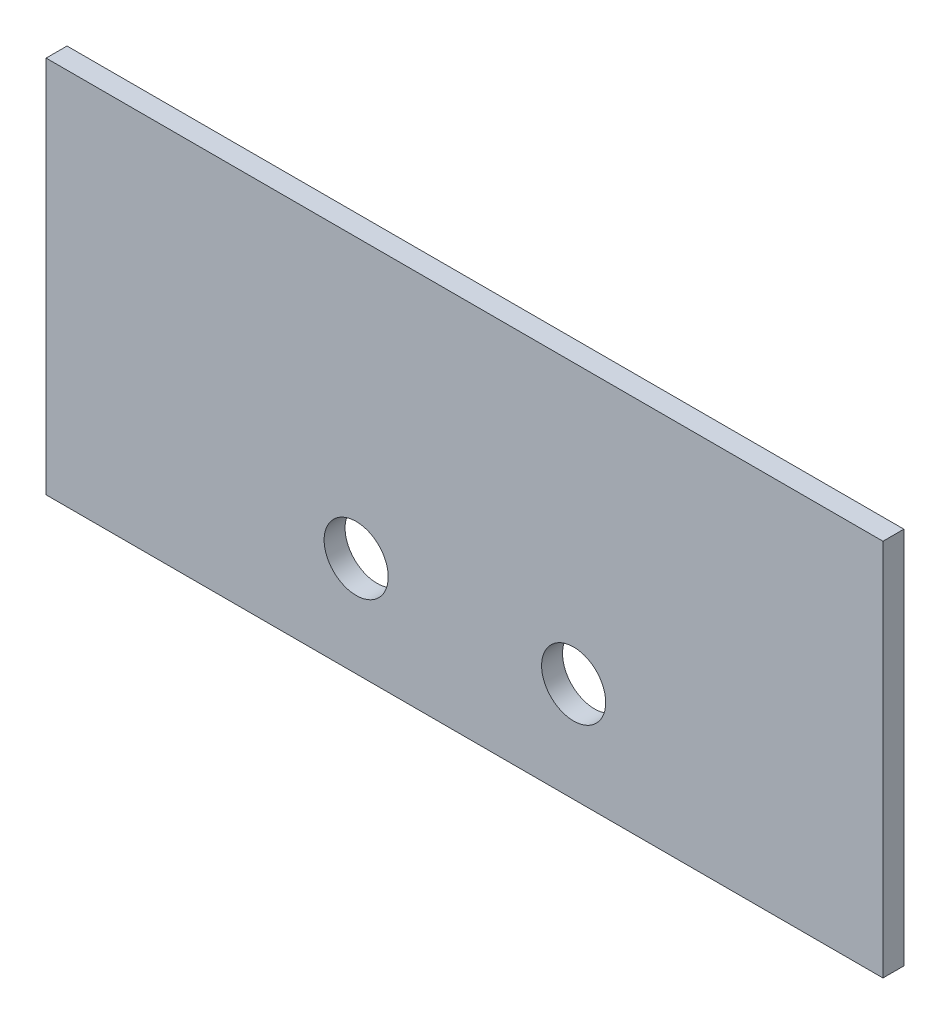
ISO-10303-21;
HEADER;
FILE_DESCRIPTION(('STEP AP214'),'2;1');
FILE_NAME('part.step','',(''),(''),'','','');
FILE_SCHEMA(('AUTOMOTIVE_DESIGN { 1 0 10303 214 1 1 1 1 }'));
ENDSEC;
DATA;
#1=APPLICATION_CONTEXT('core data for automotive mechanical design processes');
#2=APPLICATION_PROTOCOL_DEFINITION('international standard','automotive_design',2000,#1);
#3=PRODUCT_CONTEXT('',#1,'mechanical');
#4=PRODUCT('Part','Part','',(#3));
#5=PRODUCT_RELATED_PRODUCT_CATEGORY('part','',(#4));
#6=PRODUCT_DEFINITION_FORMATION('','',#4);
#7=PRODUCT_DEFINITION_CONTEXT('part definition',#1,'design');
#8=PRODUCT_DEFINITION('design','',#6,#7);
#9=PRODUCT_DEFINITION_SHAPE('','',#8);
#10=(LENGTH_UNIT() NAMED_UNIT(*) SI_UNIT(.MILLI.,.METRE.));
#11=(NAMED_UNIT(*) PLANE_ANGLE_UNIT() SI_UNIT($,.RADIAN.));
#12=(NAMED_UNIT(*) SI_UNIT($,.STERADIAN.) SOLID_ANGLE_UNIT());
#13=UNCERTAINTY_MEASURE_WITH_UNIT(LENGTH_MEASURE(1.E-05),#10,'distance_accuracy_value','');
#14=(GEOMETRIC_REPRESENTATION_CONTEXT(3) GLOBAL_UNCERTAINTY_ASSIGNED_CONTEXT((#13)) GLOBAL_UNIT_ASSIGNED_CONTEXT((#10,
#11,#12)) REPRESENTATION_CONTEXT('',''));
#15=CARTESIAN_POINT('',(0.,0.,0.));
#16=DIRECTION('',(0.,0.,1.));
#17=DIRECTION('',(1.,0.,0.));
#18=AXIS2_PLACEMENT_3D('',#15,#16,#17);
#19=CARTESIAN_POINT('',(0.,0.,3.175));
#20=DIRECTION('',(0.,0.,-1.));
#21=DIRECTION('',(-1.,0.,0.));
#22=AXIS2_PLACEMENT_3D('',#19,#20,#21);
#23=PLANE('',#22);
#24=DIRECTION('',(0.,-1.,0.));
#25=VECTOR('',#24,1.);
#26=CARTESIAN_POINT('',(0.,0.,3.175));
#27=LINE('',#26,#25);
#28=CARTESIAN_POINT('',(0.,57.404,3.175));
#29=VERTEX_POINT('',#28);
#30=CARTESIAN_POINT('',(0.,0.,3.175));
#31=VERTEX_POINT('',#30);
#32=EDGE_CURVE('E85',#29,#31,#27,.T.);
#33=ORIENTED_EDGE('',*,*,#32,.T.);
#34=DIRECTION('',(1.,0.,0.));
#35=VECTOR('',#34,1.);
#36=CARTESIAN_POINT('',(0.,0.,3.175));
#37=LINE('',#36,#35);
#38=CARTESIAN_POINT('',(127.,0.,3.175));
#39=VERTEX_POINT('',#38);
#40=EDGE_CURVE('E80',#31,#39,#37,.T.);
#41=ORIENTED_EDGE('',*,*,#40,.T.);
#42=DIRECTION('',(0.,1.,0.));
#43=VECTOR('',#42,1.);
#44=CARTESIAN_POINT('',(127.,0.,3.175));
#45=LINE('',#44,#43);
#46=CARTESIAN_POINT('',(127.,57.404,3.175));
#47=VERTEX_POINT('',#46);
#48=EDGE_CURVE('E83',#39,#47,#45,.T.);
#49=ORIENTED_EDGE('',*,*,#48,.T.);
#50=DIRECTION('',(-1.,0.,0.));
#51=VECTOR('',#50,1.);
#52=CARTESIAN_POINT('',(0.,57.404,3.175));
#53=LINE('',#52,#51);
#54=EDGE_CURVE('E50',#47,#29,#53,.T.);
#55=ORIENTED_EDGE('',*,*,#54,.T.);
#56=EDGE_LOOP('',(#33,#41,#49,#55));
#57=FACE_BOUND('',#56,.T.);
#58=CARTESIAN_POINT('',(80.0560000000001,15.167,3.175));
#59=DIRECTION('',(0.,0.,1.));
#60=DIRECTION('',(1.,0.,0.));
#61=AXIS2_PLACEMENT_3D('',#58,#59,#60);
#62=CIRCLE('',#61,4.86400000000001);
#63=CARTESIAN_POINT('',(84.9200000000001,15.167,3.175));
#64=VERTEX_POINT('',#63);
#65=EDGE_CURVE('E100',#64,#64,#62,.T.);
#66=ORIENTED_EDGE('',*,*,#65,.F.);
#67=EDGE_LOOP('',(#66));
#68=FACE_BOUND('',#67,.T.);
#69=CARTESIAN_POINT('',(47.0560000000001,15.167,3.175));
#70=DIRECTION('',(0.,0.,1.));
#71=DIRECTION('',(1.,0.,0.));
#72=AXIS2_PLACEMENT_3D('',#69,#70,#71);
#73=CIRCLE('',#72,4.864);
#74=CARTESIAN_POINT('',(51.9200000000001,15.167,3.175));
#75=VERTEX_POINT('',#74);
#76=EDGE_CURVE('E115',#75,#75,#73,.T.);
#77=ORIENTED_EDGE('',*,*,#76,.F.);
#78=EDGE_LOOP('',(#77));
#79=FACE_BOUND('',#78,.T.);
#80=ADVANCED_FACE('F33',(#57,#68,#79),#23,.F.);
#81=CARTESIAN_POINT('',(0.,0.,0.));
#82=DIRECTION('',(0.,0.,-1.));
#83=DIRECTION('',(-1.,0.,0.));
#84=AXIS2_PLACEMENT_3D('',#81,#82,#83);
#85=PLANE('',#84);
#86=CARTESIAN_POINT('',(80.0560000000001,15.167,0.));
#87=DIRECTION('',(0.,0.,1.));
#88=DIRECTION('',(1.,0.,0.));
#89=AXIS2_PLACEMENT_3D('',#86,#87,#88);
#90=CIRCLE('',#89,4.86400000000001);
#91=CARTESIAN_POINT('',(84.9200000000001,15.167,0.));
#92=VERTEX_POINT('',#91);
#93=EDGE_CURVE('E112',#92,#92,#90,.T.);
#94=ORIENTED_EDGE('',*,*,#93,.T.);
#95=EDGE_LOOP('',(#94));
#96=FACE_BOUND('',#95,.T.);
#97=DIRECTION('',(0.,-1.,0.));
#98=VECTOR('',#97,1.);
#99=CARTESIAN_POINT('',(0.,0.,0.));
#100=LINE('',#99,#98);
#101=CARTESIAN_POINT('',(0.,57.404,0.));
#102=VERTEX_POINT('',#101);
#103=CARTESIAN_POINT('',(0.,0.,0.));
#104=VERTEX_POINT('',#103);
#105=EDGE_CURVE('E97',#102,#104,#100,.T.);
#106=ORIENTED_EDGE('',*,*,#105,.F.);
#107=DIRECTION('',(-1.,0.,0.));
#108=VECTOR('',#107,1.);
#109=CARTESIAN_POINT('',(0.,57.404,0.));
#110=LINE('',#109,#108);
#111=CARTESIAN_POINT('',(127.,57.404,0.));
#112=VERTEX_POINT('',#111);
#113=EDGE_CURVE('E73',#112,#102,#110,.T.);
#114=ORIENTED_EDGE('',*,*,#113,.F.);
#115=DIRECTION('',(0.,1.,0.));
#116=VECTOR('',#115,1.);
#117=CARTESIAN_POINT('',(127.,0.,0.));
#118=LINE('',#117,#116);
#119=CARTESIAN_POINT('',(127.,0.,0.));
#120=VERTEX_POINT('',#119);
#121=EDGE_CURVE('E67',#120,#112,#118,.T.);
#122=ORIENTED_EDGE('',*,*,#121,.F.);
#123=DIRECTION('',(1.,0.,0.));
#124=VECTOR('',#123,1.);
#125=CARTESIAN_POINT('',(0.,0.,0.));
#126=LINE('',#125,#124);
#127=EDGE_CURVE('E89',#104,#120,#126,.T.);
#128=ORIENTED_EDGE('',*,*,#127,.F.);
#129=EDGE_LOOP('',(#106,#114,#122,#128));
#130=FACE_BOUND('',#129,.T.);
#131=CARTESIAN_POINT('',(47.0560000000001,15.167,0.));
#132=DIRECTION('',(0.,0.,1.));
#133=DIRECTION('',(1.,0.,0.));
#134=AXIS2_PLACEMENT_3D('',#131,#132,#133);
#135=CIRCLE('',#134,4.864);
#136=CARTESIAN_POINT('',(51.9200000000001,15.167,0.));
#137=VERTEX_POINT('',#136);
#138=EDGE_CURVE('E118',#137,#137,#135,.T.);
#139=ORIENTED_EDGE('',*,*,#138,.T.);
#140=EDGE_LOOP('',(#139));
#141=FACE_BOUND('',#140,.T.);
#142=ADVANCED_FACE('F108',(#96,#130,#141),#85,.T.);
#143=CARTESIAN_POINT('',(0.,0.,3.175));
#144=DIRECTION('',(1.,0.,0.));
#145=DIRECTION('',(0.,0.,-1.));
#146=AXIS2_PLACEMENT_3D('',#143,#144,#145);
#147=PLANE('',#146);
#148=ORIENTED_EDGE('',*,*,#105,.T.);
#149=DIRECTION('',(0.,0.,-1.));
#150=VECTOR('',#149,1.);
#151=CARTESIAN_POINT('',(0.,0.,3.175));
#152=LINE('',#151,#150);
#153=EDGE_CURVE('E11',#31,#104,#152,.T.);
#154=ORIENTED_EDGE('',*,*,#153,.F.);
#155=ORIENTED_EDGE('',*,*,#32,.F.);
#156=DIRECTION('',(0.,0.,-1.));
#157=VECTOR('',#156,1.);
#158=CARTESIAN_POINT('',(0.,57.404,3.175));
#159=LINE('',#158,#157);
#160=EDGE_CURVE('E93',#29,#102,#159,.T.);
#161=ORIENTED_EDGE('',*,*,#160,.T.);
#162=EDGE_LOOP('',(#148,#154,#155,#161));
#163=FACE_BOUND('',#162,.T.);
#164=ADVANCED_FACE('F35',(#163),#147,.F.);
#165=CARTESIAN_POINT('',(0.,0.,3.175));
#166=DIRECTION('',(0.,1.,0.));
#167=DIRECTION('',(0.,0.,1.));
#168=AXIS2_PLACEMENT_3D('',#165,#166,#167);
#169=PLANE('',#168);
#170=ORIENTED_EDGE('',*,*,#127,.T.);
#171=DIRECTION('',(0.,0.,-1.));
#172=VECTOR('',#171,1.);
#173=CARTESIAN_POINT('',(127.,0.,3.175));
#174=LINE('',#173,#172);
#175=EDGE_CURVE('E42',#39,#120,#174,.T.);
#176=ORIENTED_EDGE('',*,*,#175,.F.);
#177=ORIENTED_EDGE('',*,*,#40,.F.);
#178=ORIENTED_EDGE('',*,*,#153,.T.);
#179=EDGE_LOOP('',(#170,#176,#177,#178));
#180=FACE_BOUND('',#179,.T.);
#181=ADVANCED_FACE('F88',(#180),#169,.F.);
#182=CARTESIAN_POINT('',(127.,0.,3.175));
#183=DIRECTION('',(-1.,0.,0.));
#184=DIRECTION('',(0.,0.,1.));
#185=AXIS2_PLACEMENT_3D('',#182,#183,#184);
#186=PLANE('',#185);
#187=ORIENTED_EDGE('',*,*,#121,.T.);
#188=DIRECTION('',(0.,0.,-1.));
#189=VECTOR('',#188,1.);
#190=CARTESIAN_POINT('',(127.,57.404,3.175));
#191=LINE('',#190,#189);
#192=EDGE_CURVE('E90',#47,#112,#191,.T.);
#193=ORIENTED_EDGE('',*,*,#192,.F.);
#194=ORIENTED_EDGE('',*,*,#48,.F.);
#195=ORIENTED_EDGE('',*,*,#175,.T.);
#196=EDGE_LOOP('',(#187,#193,#194,#195));
#197=FACE_BOUND('',#196,.T.);
#198=ADVANCED_FACE('F91',(#197),#186,.F.);
#199=CARTESIAN_POINT('',(0.,57.404,3.175));
#200=DIRECTION('',(0.,-1.,0.));
#201=DIRECTION('',(0.,0.,-1.));
#202=AXIS2_PLACEMENT_3D('',#199,#200,#201);
#203=PLANE('',#202);
#204=ORIENTED_EDGE('',*,*,#113,.T.);
#205=ORIENTED_EDGE('',*,*,#160,.F.);
#206=ORIENTED_EDGE('',*,*,#54,.F.);
#207=ORIENTED_EDGE('',*,*,#192,.T.);
#208=EDGE_LOOP('',(#204,#205,#206,#207));
#209=FACE_BOUND('',#208,.T.);
#210=ADVANCED_FACE('F105',(#209),#203,.F.);
#211=CARTESIAN_POINT('',(80.0560000000001,15.167,3.175));
#212=DIRECTION('',(0.,0.,-1.));
#213=DIRECTION('',(-1.,0.,0.));
#214=AXIS2_PLACEMENT_3D('',#211,#212,#213);
#215=CYLINDRICAL_SURFACE('',#214,4.86400000000001);
#216=ORIENTED_EDGE('',*,*,#65,.T.);
#217=EDGE_LOOP('',(#216));
#218=FACE_BOUND('',#217,.T.);
#219=ORIENTED_EDGE('',*,*,#93,.F.);
#220=EDGE_LOOP('',(#219));
#221=FACE_BOUND('',#220,.T.);
#222=ADVANCED_FACE('F135',(#218,#221),#215,.F.);
#223=CARTESIAN_POINT('',(47.0560000000001,15.167,3.175));
#224=DIRECTION('',(0.,0.,-1.));
#225=DIRECTION('',(-1.,0.,0.));
#226=AXIS2_PLACEMENT_3D('',#223,#224,#225);
#227=CYLINDRICAL_SURFACE('',#226,4.864);
#228=ORIENTED_EDGE('',*,*,#76,.T.);
#229=EDGE_LOOP('',(#228));
#230=FACE_BOUND('',#229,.T.);
#231=ORIENTED_EDGE('',*,*,#138,.F.);
#232=EDGE_LOOP('',(#231));
#233=FACE_BOUND('',#232,.T.);
#234=ADVANCED_FACE('F124',(#230,#233),#227,.F.);
#235=CLOSED_SHELL('',(#80,#142,#164,#181,#198,#210,#222,#234));
#236=MANIFOLD_SOLID_BREP('B2',#235);
#237=ADVANCED_BREP_SHAPE_REPRESENTATION('',(#18,#236),#14);
#238=SHAPE_DEFINITION_REPRESENTATION(#9,#237);
ENDSEC;
END-ISO-10303-21;
